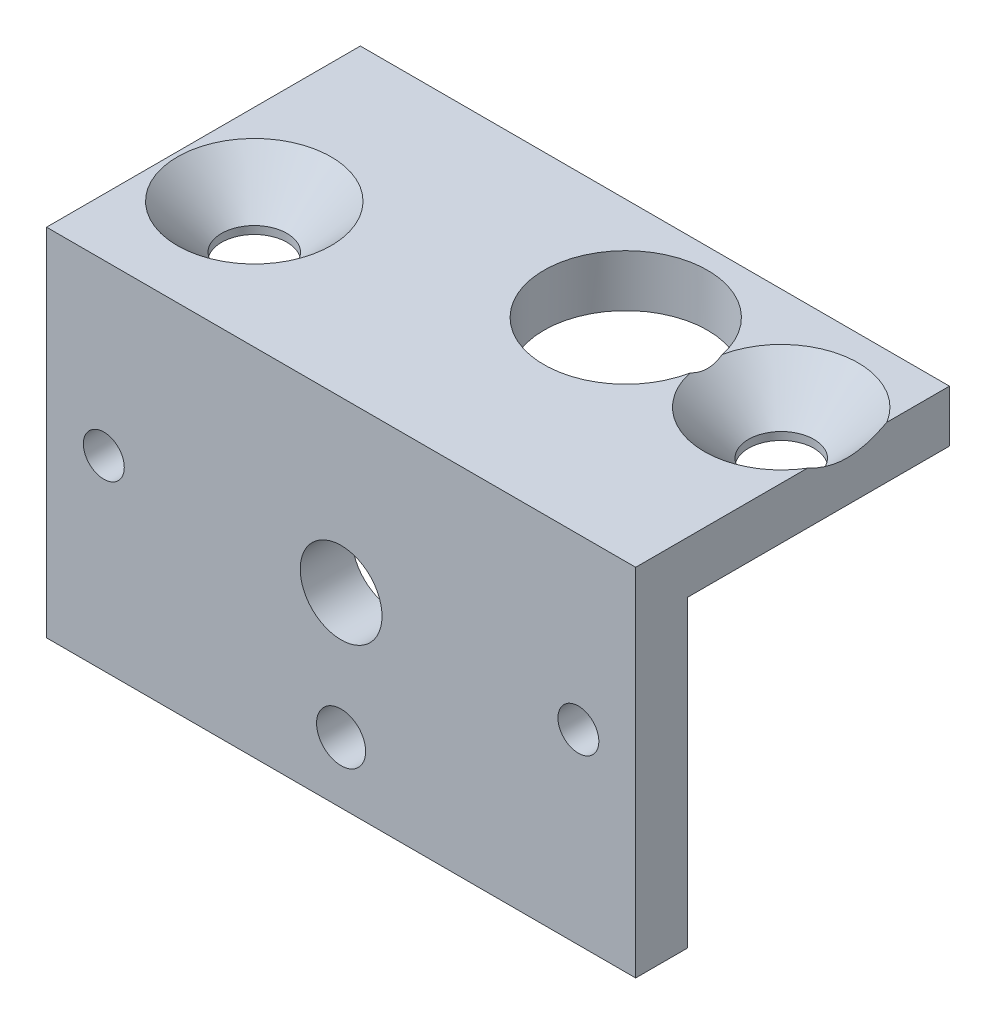
ISO-10303-21;
HEADER;
FILE_DESCRIPTION(('STEP AP214'),'2;1');
FILE_NAME('part.step','',(''),(''),'','','');
FILE_SCHEMA(('AUTOMOTIVE_DESIGN { 1 0 10303 214 1 1 1 1 }'));
ENDSEC;
DATA;
#1=APPLICATION_CONTEXT('core data for automotive mechanical design processes');
#2=APPLICATION_PROTOCOL_DEFINITION('international standard','automotive_design',2000,#1);
#3=PRODUCT_CONTEXT('',#1,'mechanical');
#4=PRODUCT('Part','Part','',(#3));
#5=PRODUCT_RELATED_PRODUCT_CATEGORY('part','',(#4));
#6=PRODUCT_DEFINITION_FORMATION('','',#4);
#7=PRODUCT_DEFINITION_CONTEXT('part definition',#1,'design');
#8=PRODUCT_DEFINITION('design','',#6,#7);
#9=PRODUCT_DEFINITION_SHAPE('','',#8);
#10=(LENGTH_UNIT() NAMED_UNIT(*) SI_UNIT(.MILLI.,.METRE.));
#11=(NAMED_UNIT(*) PLANE_ANGLE_UNIT() SI_UNIT($,.RADIAN.));
#12=(NAMED_UNIT(*) SI_UNIT($,.STERADIAN.) SOLID_ANGLE_UNIT());
#13=UNCERTAINTY_MEASURE_WITH_UNIT(LENGTH_MEASURE(1.E-05),#10,'distance_accuracy_value','');
#14=(GEOMETRIC_REPRESENTATION_CONTEXT(3) GLOBAL_UNCERTAINTY_ASSIGNED_CONTEXT((#13)) GLOBAL_UNIT_ASSIGNED_CONTEXT((#10,
#11,#12)) REPRESENTATION_CONTEXT('',''));
#15=CARTESIAN_POINT('',(0.,0.,0.));
#16=DIRECTION('',(0.,0.,1.));
#17=DIRECTION('',(1.,0.,0.));
#18=AXIS2_PLACEMENT_3D('',#15,#16,#17);
#19=CARTESIAN_POINT('',(-18.,-8.86768579755965,0.));
#20=DIRECTION('',(0.,0.,-1.));
#21=DIRECTION('',(-1.,0.,0.));
#22=AXIS2_PLACEMENT_3D('',#19,#20,#21);
#23=PLANE('',#22);
#24=CARTESIAN_POINT('',(0.,-5.13231420244036,0.));
#25=DIRECTION('',(0.,0.,1.));
#26=DIRECTION('',(1.,0.,0.));
#27=AXIS2_PLACEMENT_3D('',#24,#25,#26);
#28=CIRCLE('',#27,1.5);
#29=CARTESIAN_POINT('',(1.50000000000001,-5.13231420244036,0.));
#30=VERTEX_POINT('',#29);
#31=EDGE_CURVE('E197',#30,#30,#28,.T.);
#32=ORIENTED_EDGE('',*,*,#31,.T.);
#33=EDGE_LOOP('',(#32));
#34=FACE_BOUND('',#33,.T.);
#35=CARTESIAN_POINT('',(14.5,2.52768579755964,0.));
#36=DIRECTION('',(0.,0.,1.));
#37=DIRECTION('',(1.,0.,0.));
#38=AXIS2_PLACEMENT_3D('',#35,#36,#37);
#39=CIRCLE('',#38,1.25);
#40=CARTESIAN_POINT('',(15.75,2.52768579755964,0.));
#41=VERTEX_POINT('',#40);
#42=EDGE_CURVE('E408',#41,#41,#39,.T.);
#43=ORIENTED_EDGE('',*,*,#42,.T.);
#44=EDGE_LOOP('',(#43));
#45=FACE_BOUND('',#44,.T.);
#46=CARTESIAN_POINT('',(-14.5,2.52768579755964,0.));
#47=DIRECTION('',(0.,0.,1.));
#48=DIRECTION('',(1.,0.,0.));
#49=AXIS2_PLACEMENT_3D('',#46,#47,#48);
#50=CIRCLE('',#49,1.25);
#51=CARTESIAN_POINT('',(-13.25,2.52768579755964,0.));
#52=VERTEX_POINT('',#51);
#53=EDGE_CURVE('E159',#52,#52,#50,.T.);
#54=ORIENTED_EDGE('',*,*,#53,.T.);
#55=EDGE_LOOP('',(#54));
#56=FACE_BOUND('',#55,.T.);
#57=CARTESIAN_POINT('',(0.,2.52768579755964,0.));
#58=DIRECTION('',(0.,0.,1.));
#59=DIRECTION('',(1.,0.,0.));
#60=AXIS2_PLACEMENT_3D('',#57,#58,#59);
#61=CIRCLE('',#60,2.5);
#62=CARTESIAN_POINT('',(2.5,2.52768579755964,0.));
#63=VERTEX_POINT('',#62);
#64=EDGE_CURVE('E403',#63,#63,#61,.T.);
#65=ORIENTED_EDGE('',*,*,#64,.T.);
#66=EDGE_LOOP('',(#65));
#67=FACE_BOUND('',#66,.T.);
#68=DIRECTION('',(0.,-1.,0.));
#69=VECTOR('',#68,1.);
#70=CARTESIAN_POINT('',(-18.,12.8676857975596,0.));
#71=LINE('',#70,#69);
#72=CARTESIAN_POINT('',(-18.,9.69268579755964,0.));
#73=VERTEX_POINT('',#72);
#74=CARTESIAN_POINT('',(-18.,-8.86768579755965,0.));
#75=VERTEX_POINT('',#74);
#76=EDGE_CURVE('E132',#73,#75,#71,.T.);
#77=ORIENTED_EDGE('',*,*,#76,.F.);
#78=DIRECTION('',(1.,0.,0.));
#79=VECTOR('',#78,1.);
#80=CARTESIAN_POINT('',(-18.,9.69268579755964,0.));
#81=LINE('',#80,#79);
#82=CARTESIAN_POINT('',(18.,9.69268579755964,0.));
#83=VERTEX_POINT('',#82);
#84=EDGE_CURVE('E176',#73,#83,#81,.T.);
#85=ORIENTED_EDGE('',*,*,#84,.T.);
#86=DIRECTION('',(0.,1.,0.));
#87=VECTOR('',#86,1.);
#88=CARTESIAN_POINT('',(18.,12.8676857975596,0.));
#89=LINE('',#88,#87);
#90=CARTESIAN_POINT('',(18.,-8.86768579755964,0.));
#91=VERTEX_POINT('',#90);
#92=EDGE_CURVE('E137',#91,#83,#89,.T.);
#93=ORIENTED_EDGE('',*,*,#92,.F.);
#94=DIRECTION('',(1.,0.,0.));
#95=VECTOR('',#94,1.);
#96=CARTESIAN_POINT('',(18.,-8.86768579755964,0.));
#97=LINE('',#96,#95);
#98=EDGE_CURVE('E135',#75,#91,#97,.T.);
#99=ORIENTED_EDGE('',*,*,#98,.F.);
#100=EDGE_LOOP('',(#77,#85,#93,#99));
#101=FACE_BOUND('',#100,.T.);
#102=ADVANCED_FACE('F31',(#34,#45,#56,#67,#101),#23,.T.);
#103=CARTESIAN_POINT('',(-18.,-8.86768579755965,3.175));
#104=DIRECTION('',(0.,0.,-1.));
#105=DIRECTION('',(-1.,0.,0.));
#106=AXIS2_PLACEMENT_3D('',#103,#104,#105);
#107=PLANE('',#106);
#108=CARTESIAN_POINT('',(0.,2.52768579755964,3.175));
#109=DIRECTION('',(0.,0.,1.));
#110=DIRECTION('',(1.,0.,0.));
#111=AXIS2_PLACEMENT_3D('',#108,#109,#110);
#112=CIRCLE('',#111,2.5);
#113=CARTESIAN_POINT('',(2.5,2.52768579755964,3.175));
#114=VERTEX_POINT('',#113);
#115=EDGE_CURVE('E405',#114,#114,#112,.T.);
#116=ORIENTED_EDGE('',*,*,#115,.F.);
#117=EDGE_LOOP('',(#116));
#118=FACE_BOUND('',#117,.T.);
#119=CARTESIAN_POINT('',(-14.5,2.52768579755964,3.175));
#120=DIRECTION('',(0.,0.,1.));
#121=DIRECTION('',(1.,0.,0.));
#122=AXIS2_PLACEMENT_3D('',#119,#120,#121);
#123=CIRCLE('',#122,1.25);
#124=CARTESIAN_POINT('',(-13.25,2.52768579755964,3.175));
#125=VERTEX_POINT('',#124);
#126=EDGE_CURVE('E136',#125,#125,#123,.T.);
#127=ORIENTED_EDGE('',*,*,#126,.F.);
#128=EDGE_LOOP('',(#127));
#129=FACE_BOUND('',#128,.T.);
#130=DIRECTION('',(0.,-1.,0.));
#131=VECTOR('',#130,1.);
#132=CARTESIAN_POINT('',(-18.,12.8676857975596,3.175));
#133=LINE('',#132,#131);
#134=CARTESIAN_POINT('',(-18.,12.8676857975596,3.175));
#135=VERTEX_POINT('',#134);
#136=CARTESIAN_POINT('',(-18.,-8.86768579755965,3.175));
#137=VERTEX_POINT('',#136);
#138=EDGE_CURVE('E148',#135,#137,#133,.T.);
#139=ORIENTED_EDGE('',*,*,#138,.T.);
#140=DIRECTION('',(1.,0.,0.));
#141=VECTOR('',#140,1.);
#142=CARTESIAN_POINT('',(18.,-8.86768579755964,3.175));
#143=LINE('',#142,#141);
#144=CARTESIAN_POINT('',(18.,-8.86768579755964,3.175));
#145=VERTEX_POINT('',#144);
#146=EDGE_CURVE('E151',#137,#145,#143,.T.);
#147=ORIENTED_EDGE('',*,*,#146,.T.);
#148=DIRECTION('',(0.,1.,0.));
#149=VECTOR('',#148,1.);
#150=CARTESIAN_POINT('',(18.,12.8676857975596,3.175));
#151=LINE('',#150,#149);
#152=CARTESIAN_POINT('',(18.,12.8676857975596,3.175));
#153=VERTEX_POINT('',#152);
#154=EDGE_CURVE('E156',#145,#153,#151,.T.);
#155=ORIENTED_EDGE('',*,*,#154,.T.);
#156=DIRECTION('',(-1.,0.,0.));
#157=VECTOR('',#156,1.);
#158=CARTESIAN_POINT('',(-18.,12.8676857975596,3.175));
#159=LINE('',#158,#157);
#160=EDGE_CURVE('E124',#153,#135,#159,.T.);
#161=ORIENTED_EDGE('',*,*,#160,.T.);
#162=EDGE_LOOP('',(#139,#147,#155,#161));
#163=FACE_BOUND('',#162,.T.);
#164=CARTESIAN_POINT('',(14.5,2.52768579755964,3.175));
#165=DIRECTION('',(0.,0.,1.));
#166=DIRECTION('',(1.,0.,0.));
#167=AXIS2_PLACEMENT_3D('',#164,#165,#166);
#168=CIRCLE('',#167,1.25);
#169=CARTESIAN_POINT('',(15.75,2.52768579755964,3.175));
#170=VERTEX_POINT('',#169);
#171=EDGE_CURVE('E411',#170,#170,#168,.T.);
#172=ORIENTED_EDGE('',*,*,#171,.F.);
#173=EDGE_LOOP('',(#172));
#174=FACE_BOUND('',#173,.T.);
#175=CARTESIAN_POINT('',(0.,-5.13231420244036,3.175));
#176=DIRECTION('',(0.,0.,1.));
#177=DIRECTION('',(1.,0.,0.));
#178=AXIS2_PLACEMENT_3D('',#175,#176,#177);
#179=CIRCLE('',#178,1.5);
#180=CARTESIAN_POINT('',(1.50000000000001,-5.13231420244036,3.175));
#181=VERTEX_POINT('',#180);
#182=EDGE_CURVE('E193',#181,#181,#179,.T.);
#183=ORIENTED_EDGE('',*,*,#182,.F.);
#184=EDGE_LOOP('',(#183));
#185=FACE_BOUND('',#184,.T.);
#186=ADVANCED_FACE('F164',(#118,#129,#163,#174,#185),#107,.F.);
#187=CARTESIAN_POINT('',(-18.,12.8676857975596,3.175));
#188=DIRECTION('',(1.,0.,0.));
#189=DIRECTION('',(0.,0.,-1.));
#190=AXIS2_PLACEMENT_3D('',#187,#188,#189);
#191=PLANE('',#190);
#192=DIRECTION('',(0.,0.,-1.));
#193=VECTOR('',#192,1.);
#194=CARTESIAN_POINT('',(-18.,12.8676857975596,3.175));
#195=LINE('',#194,#193);
#196=CARTESIAN_POINT('',(-18.,12.8676857975596,-16.));
#197=VERTEX_POINT('',#196);
#198=EDGE_CURVE('E121',#135,#197,#195,.T.);
#199=ORIENTED_EDGE('',*,*,#198,.T.);
#200=DIRECTION('',(0.,-1.,0.));
#201=VECTOR('',#200,1.);
#202=CARTESIAN_POINT('',(-18.,-8.86768579755965,-16.));
#203=LINE('',#202,#201);
#204=CARTESIAN_POINT('',(-18.,9.69268579755964,-16.));
#205=VERTEX_POINT('',#204);
#206=EDGE_CURVE('E185',#197,#205,#203,.T.);
#207=ORIENTED_EDGE('',*,*,#206,.T.);
#208=DIRECTION('',(0.,0.,1.));
#209=VECTOR('',#208,1.);
#210=CARTESIAN_POINT('',(-18.,9.69268579755964,-16.));
#211=LINE('',#210,#209);
#212=EDGE_CURVE('E190',#205,#73,#211,.T.);
#213=ORIENTED_EDGE('',*,*,#212,.T.);
#214=ORIENTED_EDGE('',*,*,#76,.T.);
#215=DIRECTION('',(0.,0.,-1.));
#216=VECTOR('',#215,1.);
#217=CARTESIAN_POINT('',(-18.,-8.86768579755965,3.175));
#218=LINE('',#217,#216);
#219=EDGE_CURVE('E44',#137,#75,#218,.T.);
#220=ORIENTED_EDGE('',*,*,#219,.F.);
#221=ORIENTED_EDGE('',*,*,#138,.F.);
#222=EDGE_LOOP('',(#199,#207,#213,#214,#220,#221));
#223=FACE_BOUND('',#222,.T.);
#224=ADVANCED_FACE('F33',(#223),#191,.F.);
#225=CARTESIAN_POINT('',(18.,-8.86768579755964,3.175));
#226=DIRECTION('',(0.,1.,0.));
#227=DIRECTION('',(-1.,0.,0.));
#228=AXIS2_PLACEMENT_3D('',#225,#226,#227);
#229=PLANE('',#228);
#230=ORIENTED_EDGE('',*,*,#98,.T.);
#231=DIRECTION('',(0.,0.,-1.));
#232=VECTOR('',#231,1.);
#233=CARTESIAN_POINT('',(18.,-8.86768579755964,3.175));
#234=LINE('',#233,#232);
#235=EDGE_CURVE('E123',#145,#91,#234,.T.);
#236=ORIENTED_EDGE('',*,*,#235,.F.);
#237=ORIENTED_EDGE('',*,*,#146,.F.);
#238=ORIENTED_EDGE('',*,*,#219,.T.);
#239=EDGE_LOOP('',(#230,#236,#237,#238));
#240=FACE_BOUND('',#239,.T.);
#241=ADVANCED_FACE('F171',(#240),#229,.F.);
#242=CARTESIAN_POINT('',(18.,12.8676857975596,3.175));
#243=DIRECTION('',(-1.,0.,0.));
#244=DIRECTION('',(0.,0.,1.));
#245=AXIS2_PLACEMENT_3D('',#242,#243,#244);
#246=PLANE('',#245);
#247=DIRECTION('',(0.,0.,-1.));
#248=VECTOR('',#247,1.);
#249=CARTESIAN_POINT('',(18.,12.8676857975596,3.175));
#250=LINE('',#249,#248);
#251=CARTESIAN_POINT('',(18.,12.8676857975596,-12.1709490244301));
#252=VERTEX_POINT('',#251);
#253=CARTESIAN_POINT('',(18.,12.8676857975596,-16.));
#254=VERTEX_POINT('',#253);
#255=EDGE_CURVE('E110',#252,#254,#250,.T.);
#256=ORIENTED_EDGE('',*,*,#255,.F.);
#257=CARTESIAN_POINT('',(18.,12.8678857975597,-12.1713363425672));
#258=CARTESIAN_POINT('',(18.,12.7959386955364,-12.0318970823971));
#259=CARTESIAN_POINT('',(18.,12.7274214418338,-11.8905158903555));
#260=CARTESIAN_POINT('',(18.,12.5993523947778,-11.6031236291161));
#261=CARTESIAN_POINT('',(18.,12.5398360576764,-11.4570968590126));
#262=CARTESIAN_POINT('',(18.,12.4328222334685,-11.1617250756734));
#263=CARTESIAN_POINT('',(18.,12.3852471595075,-11.0124087240407));
#264=CARTESIAN_POINT('',(18.,12.3044179600539,-10.7100982722428));
#265=CARTESIAN_POINT('',(18.,12.2711423092464,-10.5571100686014));
#266=CARTESIAN_POINT('',(18.,12.2269427297081,-10.2834293242566));
#267=CARTESIAN_POINT('',(18.,12.2126616187425,-10.1632787747525));
#268=CARTESIAN_POINT('',(18.,12.1948269909062,-9.92214978353221));
#269=CARTESIAN_POINT('',(18.,12.1912748413107,-9.80117123826689));
#270=CARTESIAN_POINT('',(18.,12.1951103999339,-9.55936728528518));
#271=CARTESIAN_POINT('',(18.,12.2025002614564,-9.4385419123955));
#272=CARTESIAN_POINT('',(18.,12.2278034304409,-9.1980299984082));
#273=CARTESIAN_POINT('',(18.,12.2457158480448,-9.07834336188102));
#274=CARTESIAN_POINT('',(18.,12.295857900732,-8.816261917221));
#275=CARTESIAN_POINT('',(18.,12.3302822212167,-8.67428934127105));
#276=CARTESIAN_POINT('',(18.,12.4110846576698,-8.39361818846004));
#277=CARTESIAN_POINT('',(18.,12.457481136981,-8.25492500158143));
#278=CARTESIAN_POINT('',(18.,12.5601768066675,-7.98073693549623));
#279=CARTESIAN_POINT('',(18.,12.616511630941,-7.84525562503449));
#280=CARTESIAN_POINT('',(18.,12.7368801458669,-7.57828596571475));
#281=CARTESIAN_POINT('',(18.,12.8008873212639,-7.44678572581254));
#282=CARTESIAN_POINT('',(18.,12.8678857975597,-7.31695480008409));
#283=B_SPLINE_CURVE_WITH_KNOTS('',3,(#257,#258,#259,#260,#261,#262,#263,#264,#265,#266,#267,
#268,#269,#270,#271,#272,#273,#274,#275,#276,#277,#278,#279,#280,#281,#282),.UNSPECIFIED.,.F.,
.F.,(4,2,2,2,2,2,2,2,2,2,2,2,4),(0.,0.470903474765865,0.943616139487419,1.41317290731656,
1.88202034108288,2.24456852706229,2.60716291343746,2.96982866509238,3.33246375171079,
3.77008818279411,4.20838789037173,4.6482923012406,5.0867180305899),.UNSPECIFIED.);
#284=CARTESIAN_POINT('',(18.,12.8676857975596,-7.31734211822112));
#285=VERTEX_POINT('',#284);
#286=EDGE_CURVE('E11',#252,#285,#283,.T.);
#287=ORIENTED_EDGE('',*,*,#286,.T.);
#288=EDGE_CURVE('E120',#153,#285,#250,.T.);
#289=ORIENTED_EDGE('',*,*,#288,.F.);
#290=ORIENTED_EDGE('',*,*,#154,.F.);
#291=ORIENTED_EDGE('',*,*,#235,.T.);
#292=ORIENTED_EDGE('',*,*,#92,.T.);
#293=DIRECTION('',(0.,0.,1.));
#294=VECTOR('',#293,1.);
#295=CARTESIAN_POINT('',(18.,9.69268579755964,-16.));
#296=LINE('',#295,#294);
#297=CARTESIAN_POINT('',(18.,9.69268579755964,-16.));
#298=VERTEX_POINT('',#297);
#299=EDGE_CURVE('E58',#298,#83,#296,.T.);
#300=ORIENTED_EDGE('',*,*,#299,.F.);
#301=DIRECTION('',(0.,1.,0.));
#302=VECTOR('',#301,1.);
#303=CARTESIAN_POINT('',(18.,-8.86768579755965,-16.));
#304=LINE('',#303,#302);
#305=EDGE_CURVE('E119',#298,#254,#304,.T.);
#306=ORIENTED_EDGE('',*,*,#305,.T.);
#307=EDGE_LOOP('',(#256,#287,#289,#290,#291,#292,#300,#306));
#308=FACE_BOUND('',#307,.T.);
#309=ADVANCED_FACE('F117',(#308),#246,.F.);
#310=CARTESIAN_POINT('',(-18.,12.8676857975596,3.175));
#311=DIRECTION('',(0.,-1.,0.));
#312=DIRECTION('',(1.,0.,0.));
#313=AXIS2_PLACEMENT_3D('',#310,#311,#312);
#314=PLANE('',#313);
#315=CARTESIAN_POINT('',(-13.025,12.8676857975596,-4.54414557132564));
#316=DIRECTION('',(0.,1.,0.));
#317=DIRECTION('',(0.,0.,1.));
#318=AXIS2_PLACEMENT_3D('',#315,#316,#317);
#319=CIRCLE('',#318,4.7);
#320=CARTESIAN_POINT('',(-13.025,12.8676857975596,0.155854428674364));
#321=VERTEX_POINT('',#320);
#322=EDGE_CURVE('E393',#321,#321,#319,.T.);
#323=ORIENTED_EDGE('',*,*,#322,.F.);
#324=EDGE_LOOP('',(#323));
#325=FACE_BOUND('',#324,.T.);
#326=ORIENTED_EDGE('',*,*,#288,.T.);
#327=CARTESIAN_POINT('',(13.975,12.8676857975596,-9.74414557132563));
#328=DIRECTION('',(0.,1.,0.));
#329=DIRECTION('',(0.,0.,1.));
#330=AXIS2_PLACEMENT_3D('',#327,#328,#329);
#331=CIRCLE('',#330,4.7);
#332=CARTESIAN_POINT('',(9.37815789473684,12.8676857975596,-8.76483833696055));
#333=VERTEX_POINT('',#332);
#334=EDGE_CURVE('E51',#333,#285,#331,.T.);
#335=ORIENTED_EDGE('',*,*,#334,.F.);
#336=CARTESIAN_POINT('',(4.475,12.8676857975596,-9.74414557132564));
#337=DIRECTION('',(0.,-1.,0.));
#338=DIRECTION('',(1.,0.,0.));
#339=AXIS2_PLACEMENT_3D('',#336,#337,#338);
#340=CIRCLE('',#339,5.);
#341=CARTESIAN_POINT('',(9.37815789473684,12.8676857975596,-10.7234528056907));
#342=VERTEX_POINT('',#341);
#343=EDGE_CURVE('E113',#333,#342,#340,.T.);
#344=ORIENTED_EDGE('',*,*,#343,.T.);
#345=EDGE_CURVE('E100',#252,#342,#331,.T.);
#346=ORIENTED_EDGE('',*,*,#345,.F.);
#347=ORIENTED_EDGE('',*,*,#255,.T.);
#348=DIRECTION('',(-1.,0.,0.));
#349=VECTOR('',#348,1.);
#350=CARTESIAN_POINT('',(-18.,12.8676857975596,-16.));
#351=LINE('',#350,#349);
#352=EDGE_CURVE('E166',#254,#197,#351,.T.);
#353=ORIENTED_EDGE('',*,*,#352,.T.);
#354=ORIENTED_EDGE('',*,*,#198,.F.);
#355=ORIENTED_EDGE('',*,*,#160,.F.);
#356=EDGE_LOOP('',(#326,#335,#344,#346,#347,#353,#354,#355));
#357=FACE_BOUND('',#356,.T.);
#358=ADVANCED_FACE('F108',(#325,#357),#314,.F.);
#359=CARTESIAN_POINT('',(-14.5,2.52768579755964,3.175));
#360=DIRECTION('',(0.,0.,-1.));
#361=DIRECTION('',(-1.,0.,0.));
#362=AXIS2_PLACEMENT_3D('',#359,#360,#361);
#363=CYLINDRICAL_SURFACE('',#362,1.25);
#364=ORIENTED_EDGE('',*,*,#126,.T.);
#365=EDGE_LOOP('',(#364));
#366=FACE_BOUND('',#365,.T.);
#367=ORIENTED_EDGE('',*,*,#53,.F.);
#368=EDGE_LOOP('',(#367));
#369=FACE_BOUND('',#368,.T.);
#370=ADVANCED_FACE('F217',(#366,#369),#363,.F.);
#371=CARTESIAN_POINT('',(14.5,2.52768579755964,3.175));
#372=DIRECTION('',(0.,0.,-1.));
#373=DIRECTION('',(-1.,0.,0.));
#374=AXIS2_PLACEMENT_3D('',#371,#372,#373);
#375=CYLINDRICAL_SURFACE('',#374,1.25);
#376=ORIENTED_EDGE('',*,*,#171,.T.);
#377=EDGE_LOOP('',(#376));
#378=FACE_BOUND('',#377,.T.);
#379=ORIENTED_EDGE('',*,*,#42,.F.);
#380=EDGE_LOOP('',(#379));
#381=FACE_BOUND('',#380,.T.);
#382=ADVANCED_FACE('F247',(#378,#381),#375,.F.);
#383=CARTESIAN_POINT('',(0.,2.52768579755964,3.175));
#384=DIRECTION('',(0.,0.,-1.));
#385=DIRECTION('',(-1.,0.,0.));
#386=AXIS2_PLACEMENT_3D('',#383,#384,#385);
#387=CYLINDRICAL_SURFACE('',#386,2.5);
#388=ORIENTED_EDGE('',*,*,#115,.T.);
#389=EDGE_LOOP('',(#388));
#390=FACE_BOUND('',#389,.T.);
#391=ORIENTED_EDGE('',*,*,#64,.F.);
#392=EDGE_LOOP('',(#391));
#393=FACE_BOUND('',#392,.T.);
#394=ADVANCED_FACE('F257',(#390,#393),#387,.F.);
#395=CARTESIAN_POINT('',(0.,-5.13231420244036,3.175));
#396=DIRECTION('',(0.,0.,-1.));
#397=DIRECTION('',(-1.,0.,0.));
#398=AXIS2_PLACEMENT_3D('',#395,#396,#397);
#399=CYLINDRICAL_SURFACE('',#398,1.5);
#400=ORIENTED_EDGE('',*,*,#182,.T.);
#401=EDGE_LOOP('',(#400));
#402=FACE_BOUND('',#401,.T.);
#403=ORIENTED_EDGE('',*,*,#31,.F.);
#404=EDGE_LOOP('',(#403));
#405=FACE_BOUND('',#404,.T.);
#406=ADVANCED_FACE('F267',(#402,#405),#399,.F.);
#407=CARTESIAN_POINT('',(-18.,9.69268579755964,-16.));
#408=DIRECTION('',(0.,-1.,0.));
#409=DIRECTION('',(1.,0.,0.));
#410=AXIS2_PLACEMENT_3D('',#407,#408,#409);
#411=PLANE('',#410);
#412=CARTESIAN_POINT('',(13.975,9.69268579755964,-9.74414557132563));
#413=DIRECTION('',(0.,-1.,0.));
#414=DIRECTION('',(1.,0.,0.));
#415=AXIS2_PLACEMENT_3D('',#412,#413,#414);
#416=CIRCLE('',#415,2.00000000000001);
#417=CARTESIAN_POINT('',(15.975,9.69268579755964,-9.74414557132563));
#418=VERTEX_POINT('',#417);
#419=EDGE_CURVE('E378',#418,#418,#416,.T.);
#420=ORIENTED_EDGE('',*,*,#419,.F.);
#421=EDGE_LOOP('',(#420));
#422=FACE_BOUND('',#421,.T.);
#423=CARTESIAN_POINT('',(-13.025,9.69268579755964,-4.54414557132564));
#424=DIRECTION('',(0.,-1.,0.));
#425=DIRECTION('',(1.,0.,0.));
#426=AXIS2_PLACEMENT_3D('',#423,#424,#425);
#427=CIRCLE('',#426,2.);
#428=CARTESIAN_POINT('',(-11.025,9.69268579755964,-4.54414557132564));
#429=VERTEX_POINT('',#428);
#430=EDGE_CURVE('E180',#429,#429,#427,.T.);
#431=ORIENTED_EDGE('',*,*,#430,.F.);
#432=EDGE_LOOP('',(#431));
#433=FACE_BOUND('',#432,.T.);
#434=CARTESIAN_POINT('',(4.475,9.69268579755964,-9.74414557132564));
#435=DIRECTION('',(0.,-1.,0.));
#436=DIRECTION('',(1.,0.,0.));
#437=AXIS2_PLACEMENT_3D('',#434,#435,#436);
#438=CIRCLE('',#437,5.);
#439=CARTESIAN_POINT('',(9.475,9.69268579755964,-9.74414557132564));
#440=VERTEX_POINT('',#439);
#441=EDGE_CURVE('E177',#440,#440,#438,.T.);
#442=ORIENTED_EDGE('',*,*,#441,.F.);
#443=EDGE_LOOP('',(#442));
#444=FACE_BOUND('',#443,.T.);
#445=ORIENTED_EDGE('',*,*,#84,.F.);
#446=ORIENTED_EDGE('',*,*,#212,.F.);
#447=DIRECTION('',(1.,0.,0.));
#448=VECTOR('',#447,1.);
#449=CARTESIAN_POINT('',(-18.,9.69268579755964,-16.));
#450=LINE('',#449,#448);
#451=EDGE_CURVE('E187',#205,#298,#450,.T.);
#452=ORIENTED_EDGE('',*,*,#451,.T.);
#453=ORIENTED_EDGE('',*,*,#299,.T.);
#454=EDGE_LOOP('',(#445,#446,#452,#453));
#455=FACE_BOUND('',#454,.T.);
#456=ADVANCED_FACE('F202',(#422,#433,#444,#455),#411,.T.);
#457=CARTESIAN_POINT('',(-18.,12.8676857975596,-16.));
#458=DIRECTION('',(0.,0.,1.));
#459=DIRECTION('',(1.,0.,0.));
#460=AXIS2_PLACEMENT_3D('',#457,#458,#459);
#461=PLANE('',#460);
#462=ORIENTED_EDGE('',*,*,#352,.F.);
#463=ORIENTED_EDGE('',*,*,#305,.F.);
#464=ORIENTED_EDGE('',*,*,#451,.F.);
#465=ORIENTED_EDGE('',*,*,#206,.F.);
#466=EDGE_LOOP('',(#462,#463,#464,#465));
#467=FACE_BOUND('',#466,.T.);
#468=ADVANCED_FACE('F310',(#467),#461,.F.);
#469=CARTESIAN_POINT('',(4.475,19.6926857975596,-9.74414557132564));
#470=DIRECTION('',(0.,-1.,0.));
#471=DIRECTION('',(1.,0.,0.));
#472=AXIS2_PLACEMENT_3D('',#469,#470,#471);
#473=CYLINDRICAL_SURFACE('',#472,5.);
#474=ORIENTED_EDGE('',*,*,#441,.T.);
#475=EDGE_LOOP('',(#474));
#476=FACE_BOUND('',#475,.T.);
#477=ORIENTED_EDGE('',*,*,#343,.F.);
#478=CARTESIAN_POINT('',(9.37805894526308,12.8678857975598,-8.76434305077583));
#479=CARTESIAN_POINT('',(9.38998529258299,12.8437797885901,-8.82400530564076));
#480=CARTESIAN_POINT('',(9.40095805830428,12.821416477412,-8.88460038742732));
#481=CARTESIAN_POINT('',(9.42083329714526,12.7806658876555,-9.00752803688234));
#482=CARTESIAN_POINT('',(9.42973307195989,12.7622837933799,-9.06986275212795));
#483=CARTESIAN_POINT('',(9.44524576790227,12.7300962697811,-9.1958102735937));
#484=CARTESIAN_POINT('',(9.45186499121341,12.7162782323729,-9.25941903515964));
#485=CARTESIAN_POINT('',(9.46269312705081,12.6936066557661,-9.38769346472629));
#486=CARTESIAN_POINT('',(9.46690316228801,12.6847508041687,-9.4523586259575));
#487=CARTESIAN_POINT('',(9.47282644530809,12.6722766782467,-9.58282928429306));
#488=CARTESIAN_POINT('',(9.47451989648036,12.6686999332885,-9.64863974511075));
#489=CARTESIAN_POINT('',(9.47530428273799,12.6670428311325,-9.78035217826971));
#490=CARTESIAN_POINT('',(9.47439417050929,12.6689646858114,-9.84625417677566));
#491=CARTESIAN_POINT('',(9.46776805419871,12.6829416489739,-10.0431552707884));
#492=CARTESIAN_POINT('',(9.45816551127663,12.7031886900967,-10.1735551013282));
#493=CARTESIAN_POINT('',(9.43576193872665,12.7498011610678,-10.3736273331011));
#494=CARTESIAN_POINT('',(9.42611243952822,12.7697906277757,-10.4452985887688));
#495=CARTESIAN_POINT('',(9.40407221651022,12.8150665225785,-10.5863497028541));
#496=CARTESIAN_POINT('',(9.39168750764748,12.840341321398,-10.6557342110924));
#497=CARTESIAN_POINT('',(9.37805894526316,12.8678857975596,-10.723948091875));
#498=B_SPLINE_CURVE_WITH_KNOTS('',3,(#478,#479,#480,#481,#482,#483,#484,#485,#486,#487,#488,
#489,#490,#491,#492,#493,#494,#495,#496,#497),.UNSPECIFIED.,.F.,.F.,(4,2,2,2,2,2,2,2,2,4),(0.,
0.19634765836535,0.392949481654248,0.589003564594835,0.78496620938937,0.982462373957266,
1.18003799485538,1.57457830643797,1.79944317893501,2.02381839306054),.UNSPECIFIED.);
#499=EDGE_CURVE('E175',#333,#342,#498,.T.);
#500=ORIENTED_EDGE('',*,*,#499,.T.);
#501=EDGE_LOOP('',(#477,#500));
#502=FACE_BOUND('',#501,.T.);
#503=ADVANCED_FACE('F174',(#476,#502),#473,.F.);
#504=CARTESIAN_POINT('',(-13.025,19.6926857975596,-4.54414557132564));
#505=DIRECTION('',(0.,-1.,0.));
#506=DIRECTION('',(1.,0.,0.));
#507=AXIS2_PLACEMENT_3D('',#504,#505,#506);
#508=CYLINDRICAL_SURFACE('',#507,2.);
#509=CARTESIAN_POINT('',(-13.025,10.1676857975596,-4.54414557132564));
#510=DIRECTION('',(0.,1.,0.));
#511=DIRECTION('',(0.,0.,1.));
#512=AXIS2_PLACEMENT_3D('',#509,#510,#511);
#513=CIRCLE('',#512,1.99999999999999);
#514=CARTESIAN_POINT('',(-13.025,10.1676857975596,-2.54414557132565));
#515=VERTEX_POINT('',#514);
#516=EDGE_CURVE('E172',#515,#515,#513,.T.);
#517=ORIENTED_EDGE('',*,*,#516,.T.);
#518=EDGE_LOOP('',(#517));
#519=FACE_BOUND('',#518,.T.);
#520=ORIENTED_EDGE('',*,*,#430,.T.);
#521=EDGE_LOOP('',(#520));
#522=FACE_BOUND('',#521,.T.);
#523=ADVANCED_FACE('F325',(#519,#522),#508,.F.);
#524=CARTESIAN_POINT('',(13.975,19.6926857975596,-9.74414557132563));
#525=DIRECTION('',(0.,-1.,0.));
#526=DIRECTION('',(1.,0.,0.));
#527=AXIS2_PLACEMENT_3D('',#524,#525,#526);
#528=CYLINDRICAL_SURFACE('',#527,2.00000000000001);
#529=CARTESIAN_POINT('',(13.975,10.1676857975596,-9.74414557132563));
#530=DIRECTION('',(0.,1.,0.));
#531=DIRECTION('',(0.,0.,1.));
#532=AXIS2_PLACEMENT_3D('',#529,#530,#531);
#533=CIRCLE('',#532,1.99999999999999);
#534=CARTESIAN_POINT('',(13.975,10.1676857975596,-7.74414557132564));
#535=VERTEX_POINT('',#534);
#536=EDGE_CURVE('E114',#535,#535,#533,.T.);
#537=ORIENTED_EDGE('',*,*,#536,.T.);
#538=EDGE_LOOP('',(#537));
#539=FACE_BOUND('',#538,.T.);
#540=ORIENTED_EDGE('',*,*,#419,.T.);
#541=EDGE_LOOP('',(#540));
#542=FACE_BOUND('',#541,.T.);
#543=ADVANCED_FACE('F334',(#539,#542),#528,.F.);
#544=CARTESIAN_POINT('',(13.975,12.8676857975596,-9.74414557132563));
#545=DIRECTION('',(0.,1.,0.));
#546=DIRECTION('',(0.,0.,1.));
#547=AXIS2_PLACEMENT_3D('',#544,#545,#546);
#548=CONICAL_SURFACE('',#547,4.7,0.785398163397448);
#549=ORIENTED_EDGE('',*,*,#536,.F.);
#550=EDGE_LOOP('',(#549));
#551=FACE_BOUND('',#550,.T.);
#552=ORIENTED_EDGE('',*,*,#334,.T.);
#553=ORIENTED_EDGE('',*,*,#286,.F.);
#554=ORIENTED_EDGE('',*,*,#345,.T.);
#555=ORIENTED_EDGE('',*,*,#499,.F.);
#556=EDGE_LOOP('',(#552,#553,#554,#555));
#557=FACE_BOUND('',#556,.T.);
#558=ADVANCED_FACE('F99',(#551,#557),#548,.F.);
#559=CARTESIAN_POINT('',(-13.025,12.8676857975596,-4.54414557132564));
#560=DIRECTION('',(0.,1.,0.));
#561=DIRECTION('',(0.,0.,1.));
#562=AXIS2_PLACEMENT_3D('',#559,#560,#561);
#563=CONICAL_SURFACE('',#562,4.7,0.785398163397449);
#564=ORIENTED_EDGE('',*,*,#516,.F.);
#565=EDGE_LOOP('',(#564));
#566=FACE_BOUND('',#565,.T.);
#567=ORIENTED_EDGE('',*,*,#322,.T.);
#568=EDGE_LOOP('',(#567));
#569=FACE_BOUND('',#568,.T.);
#570=ADVANCED_FACE('F351',(#566,#569),#563,.F.);
#571=CLOSED_SHELL('',(#102,#186,#224,#241,#309,#358,#370,#382,#394,#406,#456,#468,#503,#523,
#543,#558,#570));
#572=MANIFOLD_SOLID_BREP('B2',#571);
#573=ADVANCED_BREP_SHAPE_REPRESENTATION('',(#18,#572),#14);
#574=SHAPE_DEFINITION_REPRESENTATION(#9,#573);
ENDSEC;
END-ISO-10303-21;
